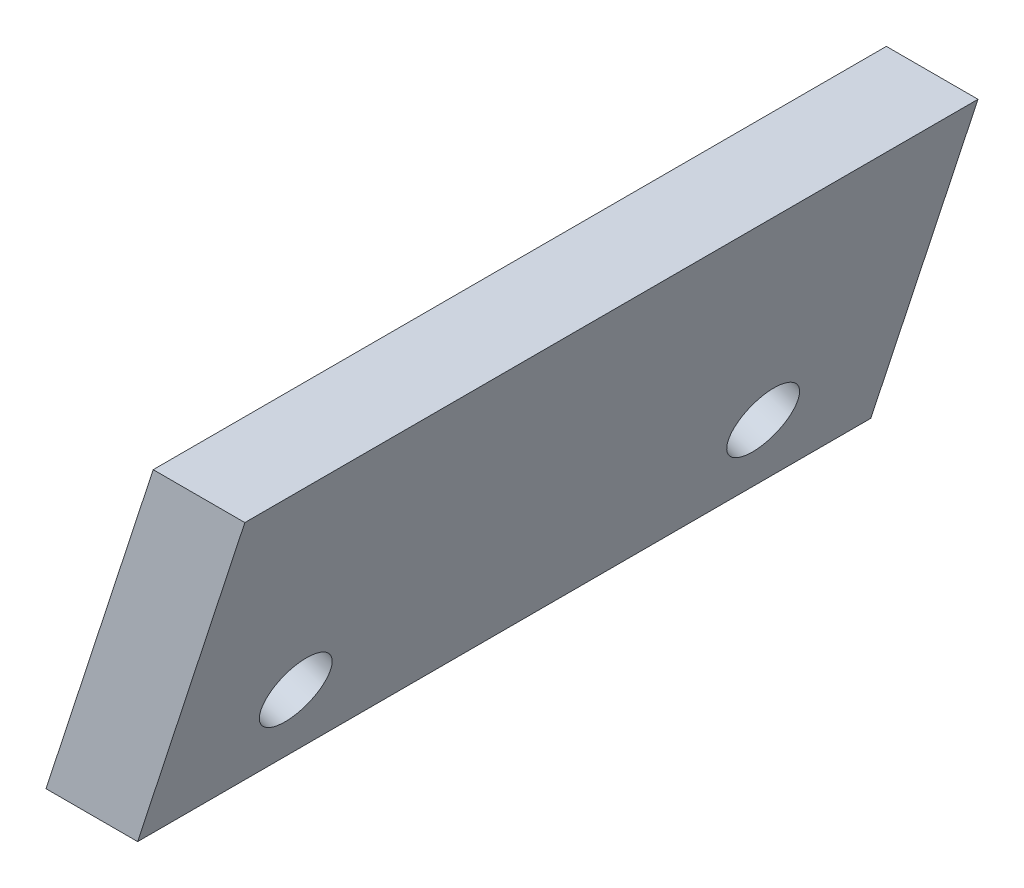
ISO-10303-21;
HEADER;
FILE_DESCRIPTION(('STEP AP214'),'2;1');
FILE_NAME('part.step','',(''),(''),'','','');
FILE_SCHEMA(('AUTOMOTIVE_DESIGN { 1 0 10303 214 1 1 1 1 }'));
ENDSEC;
DATA;
#1=APPLICATION_CONTEXT('core data for automotive mechanical design processes');
#2=APPLICATION_PROTOCOL_DEFINITION('international standard','automotive_design',2000,#1);
#3=PRODUCT_CONTEXT('',#1,'mechanical');
#4=PRODUCT('Part','Part','',(#3));
#5=PRODUCT_RELATED_PRODUCT_CATEGORY('part','',(#4));
#6=PRODUCT_DEFINITION_FORMATION('','',#4);
#7=PRODUCT_DEFINITION_CONTEXT('part definition',#1,'design');
#8=PRODUCT_DEFINITION('design','',#6,#7);
#9=PRODUCT_DEFINITION_SHAPE('','',#8);
#10=(LENGTH_UNIT() NAMED_UNIT(*) SI_UNIT(.MILLI.,.METRE.));
#11=(NAMED_UNIT(*) PLANE_ANGLE_UNIT() SI_UNIT($,.RADIAN.));
#12=(NAMED_UNIT(*) SI_UNIT($,.STERADIAN.) SOLID_ANGLE_UNIT());
#13=UNCERTAINTY_MEASURE_WITH_UNIT(LENGTH_MEASURE(1.E-05),#10,'distance_accuracy_value','');
#14=(GEOMETRIC_REPRESENTATION_CONTEXT(3) GLOBAL_UNCERTAINTY_ASSIGNED_CONTEXT((#13)) GLOBAL_UNIT_ASSIGNED_CONTEXT((#10,
#11,#12)) REPRESENTATION_CONTEXT('',''));
#15=CARTESIAN_POINT('',(0.,0.,0.));
#16=DIRECTION('',(0.,0.,1.));
#17=DIRECTION('',(1.,0.,0.));
#18=AXIS2_PLACEMENT_3D('',#15,#16,#17);
#19=CARTESIAN_POINT('',(0.,0.,20.));
#20=DIRECTION('',(0.951056516295155,-0.309016994374945,0.));
#21=DIRECTION('',(0.309016994374945,0.951056516295155,0.));
#22=AXIS2_PLACEMENT_3D('',#19,#20,#21);
#23=PLANE('',#22);
#24=CARTESIAN_POINT('',(0.927050983124834,2.85316954888546,3.625));
#25=DIRECTION('',(-0.951056516295155,0.309016994374945,0.));
#26=DIRECTION('',(-0.309016994374945,-0.951056516295155,0.));
#27=AXIS2_PLACEMENT_3D('',#24,#25,#26);
#28=CIRCLE('',#27,0.95);
#29=CARTESIAN_POINT('',(0.633484838468637,1.94966585840507,3.625));
#30=VERTEX_POINT('',#29);
#31=EDGE_CURVE('E108',#30,#30,#28,.T.);
#32=ORIENTED_EDGE('',*,*,#31,.F.);
#33=EDGE_LOOP('',(#32));
#34=FACE_BOUND('',#33,.T.);
#35=CARTESIAN_POINT('',(0.927050983124834,2.85316954888546,16.375));
#36=DIRECTION('',(-0.951056516295155,0.309016994374945,0.));
#37=DIRECTION('',(-0.309016994374945,-0.951056516295155,0.));
#38=AXIS2_PLACEMENT_3D('',#35,#36,#37);
#39=CIRCLE('',#38,0.950000000000001);
#40=CARTESIAN_POINT('',(0.633484838468636,1.94966585840507,16.375));
#41=VERTEX_POINT('',#40);
#42=EDGE_CURVE('E113',#41,#41,#39,.T.);
#43=ORIENTED_EDGE('',*,*,#42,.F.);
#44=EDGE_LOOP('',(#43));
#45=FACE_BOUND('',#44,.T.);
#46=DIRECTION('',(-0.309016994374945,-0.951056516295154,0.));
#47=VECTOR('',#46,1.);
#48=CARTESIAN_POINT('',(0.,0.,0.));
#49=LINE('',#48,#47);
#50=CARTESIAN_POINT('',(2.92427726609613,9.,0.));
#51=VERTEX_POINT('',#50);
#52=CARTESIAN_POINT('',(0.,0.,0.));
#53=VERTEX_POINT('',#52);
#54=EDGE_CURVE('E99',#51,#53,#49,.T.);
#55=ORIENTED_EDGE('',*,*,#54,.T.);
#56=DIRECTION('',(0.,0.,-1.));
#57=VECTOR('',#56,1.);
#58=CARTESIAN_POINT('',(0.,0.,20.));
#59=LINE('',#58,#57);
#60=CARTESIAN_POINT('',(0.,0.,20.));
#61=VERTEX_POINT('',#60);
#62=EDGE_CURVE('E11',#61,#53,#59,.T.);
#63=ORIENTED_EDGE('',*,*,#62,.F.);
#64=DIRECTION('',(-0.309016994374945,-0.951056516295154,0.));
#65=VECTOR('',#64,1.);
#66=CARTESIAN_POINT('',(0.,0.,20.));
#67=LINE('',#66,#65);
#68=CARTESIAN_POINT('',(2.92427726609613,9.,20.));
#69=VERTEX_POINT('',#68);
#70=EDGE_CURVE('E86',#69,#61,#67,.T.);
#71=ORIENTED_EDGE('',*,*,#70,.F.);
#72=DIRECTION('',(0.,0.,-1.));
#73=VECTOR('',#72,1.);
#74=CARTESIAN_POINT('',(2.92427726609613,9.,20.));
#75=LINE('',#74,#73);
#76=EDGE_CURVE('E95',#69,#51,#75,.T.);
#77=ORIENTED_EDGE('',*,*,#76,.T.);
#78=EDGE_LOOP('',(#55,#63,#71,#77));
#79=FACE_BOUND('',#78,.T.);
#80=ADVANCED_FACE('F33',(#34,#45,#79),#23,.F.);
#81=CARTESIAN_POINT('',(0.,0.,20.));
#82=DIRECTION('',(0.,1.,0.));
#83=DIRECTION('',(0.,0.,1.));
#84=AXIS2_PLACEMENT_3D('',#81,#82,#83);
#85=PLANE('',#84);
#86=DIRECTION('',(1.,0.,0.));
#87=VECTOR('',#86,1.);
#88=CARTESIAN_POINT('',(0.,0.,0.));
#89=LINE('',#88,#87);
#90=CARTESIAN_POINT('',(2.5,0.,0.));
#91=VERTEX_POINT('',#90);
#92=EDGE_CURVE('E90',#53,#91,#89,.T.);
#93=ORIENTED_EDGE('',*,*,#92,.T.);
#94=DIRECTION('',(0.,0.,-1.));
#95=VECTOR('',#94,1.);
#96=CARTESIAN_POINT('',(2.5,0.,20.));
#97=LINE('',#96,#95);
#98=CARTESIAN_POINT('',(2.5,0.,20.));
#99=VERTEX_POINT('',#98);
#100=EDGE_CURVE('E42',#99,#91,#97,.T.);
#101=ORIENTED_EDGE('',*,*,#100,.F.);
#102=DIRECTION('',(1.,0.,0.));
#103=VECTOR('',#102,1.);
#104=CARTESIAN_POINT('',(0.,0.,20.));
#105=LINE('',#104,#103);
#106=EDGE_CURVE('E81',#61,#99,#105,.T.);
#107=ORIENTED_EDGE('',*,*,#106,.F.);
#108=ORIENTED_EDGE('',*,*,#62,.T.);
#109=EDGE_LOOP('',(#93,#101,#107,#108));
#110=FACE_BOUND('',#109,.T.);
#111=ADVANCED_FACE('F89',(#110),#85,.F.);
#112=CARTESIAN_POINT('',(2.5,0.,20.));
#113=DIRECTION('',(-0.951056516295155,0.309016994374945,0.));
#114=DIRECTION('',(-0.309016994374945,-0.951056516295155,0.));
#115=AXIS2_PLACEMENT_3D('',#112,#113,#114);
#116=PLANE('',#115);
#117=CARTESIAN_POINT('',(3.18832222609352,2.11843798351988,3.625));
#118=DIRECTION('',(-0.951056516295155,0.309016994374945,0.));
#119=DIRECTION('',(-0.309016994374945,-0.951056516295155,0.));
#120=AXIS2_PLACEMENT_3D('',#117,#118,#119);
#121=CIRCLE('',#120,0.95);
#122=CARTESIAN_POINT('',(2.89475608143733,1.21493429303948,3.625));
#123=VERTEX_POINT('',#122);
#124=EDGE_CURVE('E36',#123,#123,#121,.T.);
#125=ORIENTED_EDGE('',*,*,#124,.T.);
#126=EDGE_LOOP('',(#125));
#127=FACE_BOUND('',#126,.T.);
#128=CARTESIAN_POINT('',(3.18832222609352,2.11843798351988,16.375));
#129=DIRECTION('',(-0.951056516295155,0.309016994374945,0.));
#130=DIRECTION('',(-0.309016994374945,-0.951056516295155,0.));
#131=AXIS2_PLACEMENT_3D('',#128,#129,#130);
#132=CIRCLE('',#131,0.950000000000001);
#133=CARTESIAN_POINT('',(2.89475608143732,1.21493429303948,16.375));
#134=VERTEX_POINT('',#133);
#135=EDGE_CURVE('E106',#134,#134,#132,.T.);
#136=ORIENTED_EDGE('',*,*,#135,.T.);
#137=EDGE_LOOP('',(#136));
#138=FACE_BOUND('',#137,.T.);
#139=DIRECTION('',(0.309016994374945,0.951056516295154,0.));
#140=VECTOR('',#139,1.);
#141=CARTESIAN_POINT('',(2.5,0.,0.));
#142=LINE('',#141,#140);
#143=CARTESIAN_POINT('',(5.42427726609613,9.,0.));
#144=VERTEX_POINT('',#143);
#145=EDGE_CURVE('E68',#91,#144,#142,.T.);
#146=ORIENTED_EDGE('',*,*,#145,.T.);
#147=DIRECTION('',(0.,0.,-1.));
#148=VECTOR('',#147,1.);
#149=CARTESIAN_POINT('',(5.42427726609613,9.,20.));
#150=LINE('',#149,#148);
#151=CARTESIAN_POINT('',(5.42427726609613,9.,20.));
#152=VERTEX_POINT('',#151);
#153=EDGE_CURVE('E91',#152,#144,#150,.T.);
#154=ORIENTED_EDGE('',*,*,#153,.F.);
#155=DIRECTION('',(0.309016994374945,0.951056516295154,0.));
#156=VECTOR('',#155,1.);
#157=CARTESIAN_POINT('',(2.5,0.,20.));
#158=LINE('',#157,#156);
#159=EDGE_CURVE('E84',#99,#152,#158,.T.);
#160=ORIENTED_EDGE('',*,*,#159,.F.);
#161=ORIENTED_EDGE('',*,*,#100,.T.);
#162=EDGE_LOOP('',(#146,#154,#160,#161));
#163=FACE_BOUND('',#162,.T.);
#164=ADVANCED_FACE('F93',(#127,#138,#163),#116,.F.);
#165=CARTESIAN_POINT('',(5.42427726609613,9.,20.));
#166=DIRECTION('',(0.,-1.,0.));
#167=DIRECTION('',(1.,0.,0.));
#168=AXIS2_PLACEMENT_3D('',#165,#166,#167);
#169=PLANE('',#168);
#170=DIRECTION('',(-1.,0.,0.));
#171=VECTOR('',#170,1.);
#172=CARTESIAN_POINT('',(5.42427726609613,9.,0.));
#173=LINE('',#172,#171);
#174=EDGE_CURVE('E74',#144,#51,#173,.T.);
#175=ORIENTED_EDGE('',*,*,#174,.T.);
#176=ORIENTED_EDGE('',*,*,#76,.F.);
#177=DIRECTION('',(-1.,0.,0.));
#178=VECTOR('',#177,1.);
#179=CARTESIAN_POINT('',(5.42427726609613,9.,20.));
#180=LINE('',#179,#178);
#181=EDGE_CURVE('E51',#152,#69,#180,.T.);
#182=ORIENTED_EDGE('',*,*,#181,.F.);
#183=ORIENTED_EDGE('',*,*,#153,.T.);
#184=EDGE_LOOP('',(#175,#176,#182,#183));
#185=FACE_BOUND('',#184,.T.);
#186=ADVANCED_FACE('F138',(#185),#169,.F.);
#187=CARTESIAN_POINT('',(0.,0.,20.));
#188=DIRECTION('',(0.,0.,1.));
#189=DIRECTION('',(1.,0.,0.));
#190=AXIS2_PLACEMENT_3D('',#187,#188,#189);
#191=PLANE('',#190);
#192=ORIENTED_EDGE('',*,*,#70,.T.);
#193=ORIENTED_EDGE('',*,*,#106,.T.);
#194=ORIENTED_EDGE('',*,*,#159,.T.);
#195=ORIENTED_EDGE('',*,*,#181,.T.);
#196=EDGE_LOOP('',(#192,#193,#194,#195));
#197=FACE_BOUND('',#196,.T.);
#198=ADVANCED_FACE('F82',(#197),#191,.T.);
#199=CARTESIAN_POINT('',(0.,0.,0.));
#200=DIRECTION('',(0.,0.,1.));
#201=DIRECTION('',(1.,0.,0.));
#202=AXIS2_PLACEMENT_3D('',#199,#200,#201);
#203=PLANE('',#202);
#204=ORIENTED_EDGE('',*,*,#54,.F.);
#205=ORIENTED_EDGE('',*,*,#174,.F.);
#206=ORIENTED_EDGE('',*,*,#145,.F.);
#207=ORIENTED_EDGE('',*,*,#92,.F.);
#208=EDGE_LOOP('',(#204,#205,#206,#207));
#209=FACE_BOUND('',#208,.T.);
#210=ADVANCED_FACE('F129',(#209),#203,.F.);
#211=CARTESIAN_POINT('',(5.83335586140963,1.25901445820716,16.375));
#212=DIRECTION('',(-0.951056516295154,0.309016994374945,0.));
#213=DIRECTION('',(-0.309016994374945,-0.951056516295155,0.));
#214=AXIS2_PLACEMENT_3D('',#211,#212,#213);
#215=CYLINDRICAL_SURFACE('',#214,0.950000000000001);
#216=ORIENTED_EDGE('',*,*,#42,.T.);
#217=EDGE_LOOP('',(#216));
#218=FACE_BOUND('',#217,.T.);
#219=ORIENTED_EDGE('',*,*,#135,.F.);
#220=EDGE_LOOP('',(#219));
#221=FACE_BOUND('',#220,.T.);
#222=ADVANCED_FACE('F121',(#218,#221),#215,.F.);
#223=CARTESIAN_POINT('',(5.83335586140963,1.25901445820716,3.625));
#224=DIRECTION('',(-0.951056516295154,0.309016994374945,0.));
#225=DIRECTION('',(-0.309016994374945,-0.951056516295155,0.));
#226=AXIS2_PLACEMENT_3D('',#223,#224,#225);
#227=CYLINDRICAL_SURFACE('',#226,0.95);
#228=ORIENTED_EDGE('',*,*,#31,.T.);
#229=EDGE_LOOP('',(#228));
#230=FACE_BOUND('',#229,.T.);
#231=ORIENTED_EDGE('',*,*,#124,.F.);
#232=EDGE_LOOP('',(#231));
#233=FACE_BOUND('',#232,.T.);
#234=ADVANCED_FACE('F136',(#230,#233),#227,.F.);
#235=CLOSED_SHELL('',(#80,#111,#164,#186,#198,#210,#222,#234));
#236=MANIFOLD_SOLID_BREP('B2',#235);
#237=ADVANCED_BREP_SHAPE_REPRESENTATION('',(#18,#236),#14);
#238=SHAPE_DEFINITION_REPRESENTATION(#9,#237);
ENDSEC;
END-ISO-10303-21;
